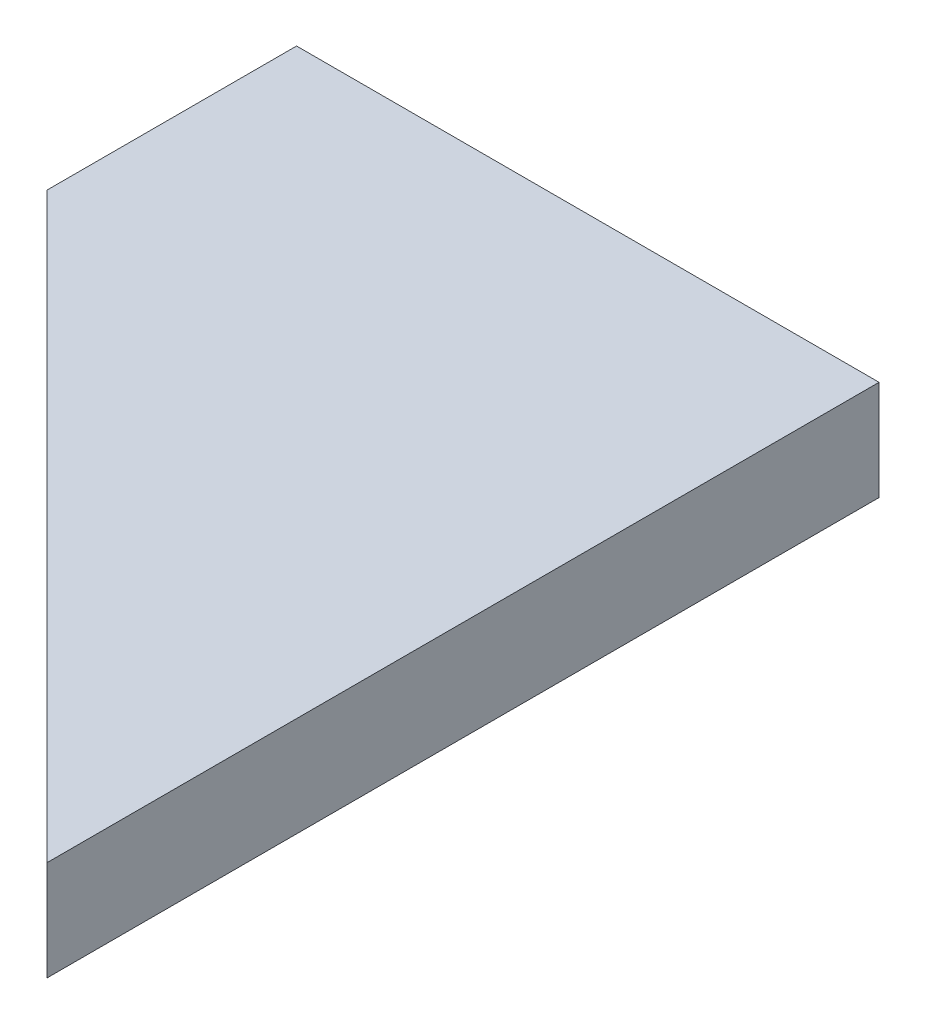
ISO-10303-21;
HEADER;
FILE_DESCRIPTION(('STEP AP214'),'2;1');
FILE_NAME('part.step','',(''),(''),'','','');
FILE_SCHEMA(('AUTOMOTIVE_DESIGN { 1 0 10303 214 1 1 1 1 }'));
ENDSEC;
DATA;
#1=APPLICATION_CONTEXT('core data for automotive mechanical design processes');
#2=APPLICATION_PROTOCOL_DEFINITION('international standard','automotive_design',2000,#1);
#3=PRODUCT_CONTEXT('',#1,'mechanical');
#4=PRODUCT('Part','Part','',(#3));
#5=PRODUCT_RELATED_PRODUCT_CATEGORY('part','',(#4));
#6=PRODUCT_DEFINITION_FORMATION('','',#4);
#7=PRODUCT_DEFINITION_CONTEXT('part definition',#1,'design');
#8=PRODUCT_DEFINITION('design','',#6,#7);
#9=PRODUCT_DEFINITION_SHAPE('','',#8);
#10=(LENGTH_UNIT() NAMED_UNIT(*) SI_UNIT(.MILLI.,.METRE.));
#11=(NAMED_UNIT(*) PLANE_ANGLE_UNIT() SI_UNIT($,.RADIAN.));
#12=(NAMED_UNIT(*) SI_UNIT($,.STERADIAN.) SOLID_ANGLE_UNIT());
#13=UNCERTAINTY_MEASURE_WITH_UNIT(LENGTH_MEASURE(1.E-05),#10,'distance_accuracy_value','');
#14=(GEOMETRIC_REPRESENTATION_CONTEXT(3) GLOBAL_UNCERTAINTY_ASSIGNED_CONTEXT((#13)) GLOBAL_UNIT_ASSIGNED_CONTEXT((#10,
#11,#12)) REPRESENTATION_CONTEXT('',''));
#15=CARTESIAN_POINT('',(0.,0.,0.));
#16=DIRECTION('',(0.,0.,1.));
#17=DIRECTION('',(1.,0.,0.));
#18=AXIS2_PLACEMENT_3D('',#15,#16,#17);
#19=CARTESIAN_POINT('',(-11.667261889578,4.,-6.66726188957806));
#20=DIRECTION('',(1.,0.,0.));
#21=DIRECTION('',(0.,0.,-1.));
#22=AXIS2_PLACEMENT_3D('',#19,#20,#21);
#23=PLANE('',#22);
#24=DIRECTION('',(0.,0.,1.));
#25=VECTOR('',#24,1.);
#26=CARTESIAN_POINT('',(-11.667261889578,0.,-6.66726188957806));
#27=LINE('',#26,#25);
#28=CARTESIAN_POINT('',(-11.667261889578,0.,-16.6672618895781));
#29=VERTEX_POINT('',#28);
#30=CARTESIAN_POINT('',(-11.667261889578,0.,-6.66726188957806));
#31=VERTEX_POINT('',#30);
#32=EDGE_CURVE('E95',#29,#31,#27,.T.);
#33=ORIENTED_EDGE('',*,*,#32,.T.);
#34=DIRECTION('',(0.,-1.,0.));
#35=VECTOR('',#34,1.);
#36=CARTESIAN_POINT('',(-11.667261889578,4.,-6.66726188957806));
#37=LINE('',#36,#35);
#38=CARTESIAN_POINT('',(-11.667261889578,4.,-6.66726188957806));
#39=VERTEX_POINT('',#38);
#40=EDGE_CURVE('E11',#39,#31,#37,.T.);
#41=ORIENTED_EDGE('',*,*,#40,.F.);
#42=DIRECTION('',(0.,0.,1.));
#43=VECTOR('',#42,1.);
#44=CARTESIAN_POINT('',(-11.667261889578,4.,-6.66726188957806));
#45=LINE('',#44,#43);
#46=CARTESIAN_POINT('',(-11.667261889578,4.,-16.6672618895781));
#47=VERTEX_POINT('',#46);
#48=EDGE_CURVE('E83',#47,#39,#45,.T.);
#49=ORIENTED_EDGE('',*,*,#48,.F.);
#50=DIRECTION('',(0.,-1.,0.));
#51=VECTOR('',#50,1.);
#52=CARTESIAN_POINT('',(-11.667261889578,4.,-16.6672618895781));
#53=LINE('',#52,#51);
#54=EDGE_CURVE('E91',#47,#29,#53,.T.);
#55=ORIENTED_EDGE('',*,*,#54,.T.);
#56=EDGE_LOOP('',(#33,#41,#49,#55));
#57=FACE_BOUND('',#56,.T.);
#58=ADVANCED_FACE('F32',(#57),#23,.F.);
#59=CARTESIAN_POINT('',(-11.667261889578,4.,-6.66726188957806));
#60=DIRECTION('',(0.707106781186549,0.,-0.707106781186546));
#61=DIRECTION('',(-0.707106781186546,0.,-0.707106781186549));
#62=AXIS2_PLACEMENT_3D('',#59,#60,#61);
#63=PLANE('',#62);
#64=DIRECTION('',(0.707106781186546,0.,0.707106781186549));
#65=VECTOR('',#64,1.);
#66=CARTESIAN_POINT('',(-11.667261889578,0.,-6.66726188957806));
#67=LINE('',#66,#65);
#68=CARTESIAN_POINT('',(11.667261889578,0.,16.6672618895781));
#69=VERTEX_POINT('',#68);
#70=EDGE_CURVE('E87',#31,#69,#67,.T.);
#71=ORIENTED_EDGE('',*,*,#70,.T.);
#72=DIRECTION('',(0.,-1.,0.));
#73=VECTOR('',#72,1.);
#74=CARTESIAN_POINT('',(11.667261889578,4.,16.6672618895781));
#75=LINE('',#74,#73);
#76=CARTESIAN_POINT('',(11.667261889578,4.,16.6672618895781));
#77=VERTEX_POINT('',#76);
#78=EDGE_CURVE('E40',#77,#69,#75,.T.);
#79=ORIENTED_EDGE('',*,*,#78,.F.);
#80=DIRECTION('',(0.707106781186546,0.,0.707106781186549));
#81=VECTOR('',#80,1.);
#82=CARTESIAN_POINT('',(-11.667261889578,4.,-6.66726188957806));
#83=LINE('',#82,#81);
#84=EDGE_CURVE('E78',#39,#77,#83,.T.);
#85=ORIENTED_EDGE('',*,*,#84,.F.);
#86=ORIENTED_EDGE('',*,*,#40,.T.);
#87=EDGE_LOOP('',(#71,#79,#85,#86));
#88=FACE_BOUND('',#87,.T.);
#89=ADVANCED_FACE('F86',(#88),#63,.F.);
#90=CARTESIAN_POINT('',(11.667261889578,4.,-16.6672618895781));
#91=DIRECTION('',(-1.,0.,0.));
#92=DIRECTION('',(0.,0.,1.));
#93=AXIS2_PLACEMENT_3D('',#90,#91,#92);
#94=PLANE('',#93);
#95=DIRECTION('',(0.,0.,-1.));
#96=VECTOR('',#95,1.);
#97=CARTESIAN_POINT('',(11.667261889578,0.,-16.6672618895781));
#98=LINE('',#97,#96);
#99=CARTESIAN_POINT('',(11.667261889578,0.,-16.6672618895781));
#100=VERTEX_POINT('',#99);
#101=EDGE_CURVE('E65',#69,#100,#98,.T.);
#102=ORIENTED_EDGE('',*,*,#101,.T.);
#103=DIRECTION('',(0.,-1.,0.));
#104=VECTOR('',#103,1.);
#105=CARTESIAN_POINT('',(11.667261889578,4.,-16.6672618895781));
#106=LINE('',#105,#104);
#107=CARTESIAN_POINT('',(11.667261889578,4.,-16.6672618895781));
#108=VERTEX_POINT('',#107);
#109=EDGE_CURVE('E88',#108,#100,#106,.T.);
#110=ORIENTED_EDGE('',*,*,#109,.F.);
#111=DIRECTION('',(0.,0.,-1.));
#112=VECTOR('',#111,1.);
#113=CARTESIAN_POINT('',(11.667261889578,4.,-16.6672618895781));
#114=LINE('',#113,#112);
#115=EDGE_CURVE('E81',#77,#108,#114,.T.);
#116=ORIENTED_EDGE('',*,*,#115,.F.);
#117=ORIENTED_EDGE('',*,*,#78,.T.);
#118=EDGE_LOOP('',(#102,#110,#116,#117));
#119=FACE_BOUND('',#118,.T.);
#120=ADVANCED_FACE('F89',(#119),#94,.F.);
#121=CARTESIAN_POINT('',(-11.667261889578,4.,-16.6672618895781));
#122=DIRECTION('',(0.,0.,1.));
#123=DIRECTION('',(1.,0.,0.));
#124=AXIS2_PLACEMENT_3D('',#121,#122,#123);
#125=PLANE('',#124);
#126=DIRECTION('',(-1.,0.,0.));
#127=VECTOR('',#126,1.);
#128=CARTESIAN_POINT('',(-11.667261889578,0.,-16.6672618895781));
#129=LINE('',#128,#127);
#130=EDGE_CURVE('E71',#100,#29,#129,.T.);
#131=ORIENTED_EDGE('',*,*,#130,.T.);
#132=ORIENTED_EDGE('',*,*,#54,.F.);
#133=DIRECTION('',(-1.,0.,0.));
#134=VECTOR('',#133,1.);
#135=CARTESIAN_POINT('',(-11.667261889578,4.,-16.6672618895781));
#136=LINE('',#135,#134);
#137=EDGE_CURVE('E48',#108,#47,#136,.T.);
#138=ORIENTED_EDGE('',*,*,#137,.F.);
#139=ORIENTED_EDGE('',*,*,#109,.T.);
#140=EDGE_LOOP('',(#131,#132,#138,#139));
#141=FACE_BOUND('',#140,.T.);
#142=ADVANCED_FACE('F102',(#141),#125,.F.);
#143=CARTESIAN_POINT('',(0.,4.,0.));
#144=DIRECTION('',(0.,-1.,0.));
#145=DIRECTION('',(0.,0.,-1.));
#146=AXIS2_PLACEMENT_3D('',#143,#144,#145);
#147=PLANE('',#146);
#148=ORIENTED_EDGE('',*,*,#48,.T.);
#149=ORIENTED_EDGE('',*,*,#84,.T.);
#150=ORIENTED_EDGE('',*,*,#115,.T.);
#151=ORIENTED_EDGE('',*,*,#137,.T.);
#152=EDGE_LOOP('',(#148,#149,#150,#151));
#153=FACE_BOUND('',#152,.T.);
#154=ADVANCED_FACE('F79',(#153),#147,.F.);
#155=CARTESIAN_POINT('',(0.,0.,0.));
#156=DIRECTION('',(0.,-1.,0.));
#157=DIRECTION('',(0.,0.,-1.));
#158=AXIS2_PLACEMENT_3D('',#155,#156,#157);
#159=PLANE('',#158);
#160=ORIENTED_EDGE('',*,*,#32,.F.);
#161=ORIENTED_EDGE('',*,*,#130,.F.);
#162=ORIENTED_EDGE('',*,*,#101,.F.);
#163=ORIENTED_EDGE('',*,*,#70,.F.);
#164=EDGE_LOOP('',(#160,#161,#162,#163));
#165=FACE_BOUND('',#164,.T.);
#166=ADVANCED_FACE('F105',(#165),#159,.T.);
#167=CLOSED_SHELL('',(#58,#89,#120,#142,#154,#166));
#168=MANIFOLD_SOLID_BREP('B2',#167);
#169=ADVANCED_BREP_SHAPE_REPRESENTATION('',(#18,#168),#14);
#170=SHAPE_DEFINITION_REPRESENTATION(#9,#169);
ENDSEC;
END-ISO-10303-21;
